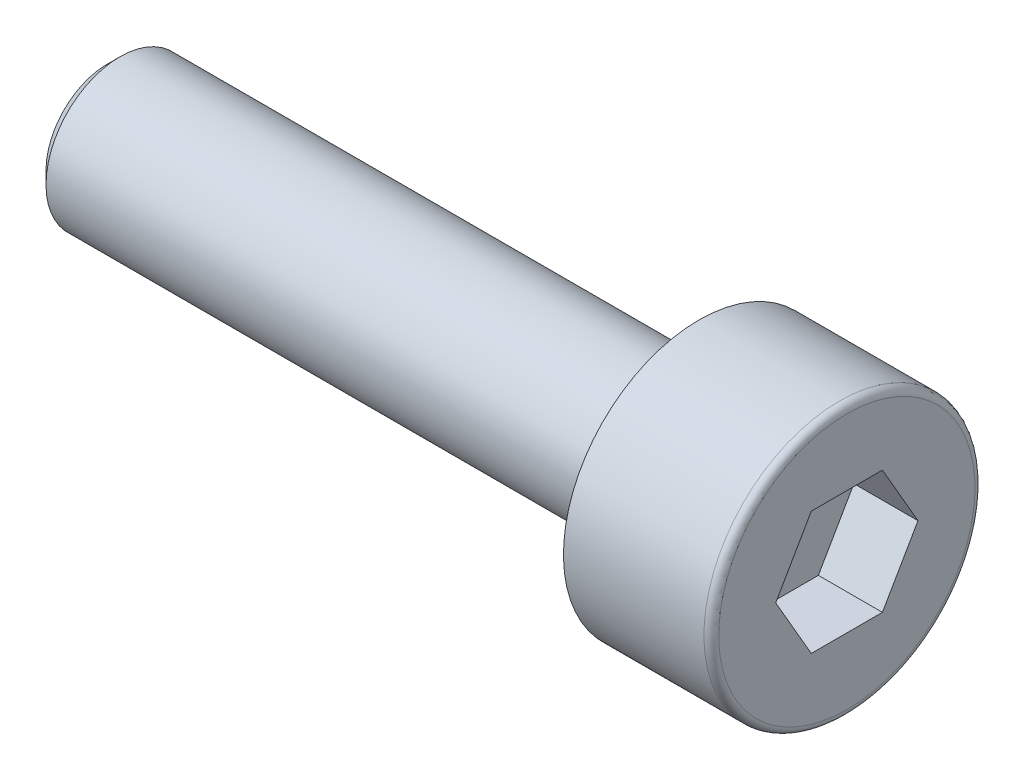
ISO-10303-21;
HEADER;
FILE_DESCRIPTION(('STEP AP214'),'2;1');
FILE_NAME('part.step','',(''),(''),'','','');
FILE_SCHEMA(('AUTOMOTIVE_DESIGN { 1 0 10303 214 1 1 1 1 }'));
ENDSEC;
DATA;
#1=APPLICATION_CONTEXT('core data for automotive mechanical design processes');
#2=APPLICATION_PROTOCOL_DEFINITION('international standard','automotive_design',2000,#1);
#3=PRODUCT_CONTEXT('',#1,'mechanical');
#4=PRODUCT('Part','Part','',(#3));
#5=PRODUCT_RELATED_PRODUCT_CATEGORY('part','',(#4));
#6=PRODUCT_DEFINITION_FORMATION('','',#4);
#7=PRODUCT_DEFINITION_CONTEXT('part definition',#1,'design');
#8=PRODUCT_DEFINITION('design','',#6,#7);
#9=PRODUCT_DEFINITION_SHAPE('','',#8);
#10=(LENGTH_UNIT() NAMED_UNIT(*) SI_UNIT(.MILLI.,.METRE.));
#11=(NAMED_UNIT(*) PLANE_ANGLE_UNIT() SI_UNIT($,.RADIAN.));
#12=(NAMED_UNIT(*) SI_UNIT($,.STERADIAN.) SOLID_ANGLE_UNIT());
#13=UNCERTAINTY_MEASURE_WITH_UNIT(LENGTH_MEASURE(1.E-05),#10,'distance_accuracy_value','');
#14=(GEOMETRIC_REPRESENTATION_CONTEXT(3) GLOBAL_UNCERTAINTY_ASSIGNED_CONTEXT((#13)) GLOBAL_UNIT_ASSIGNED_CONTEXT((#10,
#11,#12)) REPRESENTATION_CONTEXT('',''));
#15=CARTESIAN_POINT('',(0.,0.,0.));
#16=DIRECTION('',(0.,0.,1.));
#17=DIRECTION('',(1.,0.,0.));
#18=AXIS2_PLACEMENT_3D('',#15,#16,#17);
#19=CARTESIAN_POINT('',(0.,0.,0.));
#20=DIRECTION('',(1.,0.,0.));
#21=DIRECTION('',(0.,1.,0.));
#22=AXIS2_PLACEMENT_3D('',#19,#20,#21);
#23=PLANE('',#22);
#24=DIRECTION('',(0.,-0.866025403784439,0.5));
#25=VECTOR('',#24,1.);
#26=CARTESIAN_POINT('',(0.,1.25,0.721687836487035));
#27=LINE('',#26,#25);
#28=CARTESIAN_POINT('',(0.,1.25,0.721687836487035));
#29=VERTEX_POINT('',#28);
#30=CARTESIAN_POINT('',(0.,0.,1.44337567297407));
#31=VERTEX_POINT('',#30);
#32=EDGE_CURVE('E30',#29,#31,#27,.T.);
#33=ORIENTED_EDGE('',*,*,#32,.F.);
#34=DIRECTION('',(0.,0.,1.));
#35=VECTOR('',#34,1.);
#36=CARTESIAN_POINT('',(0.,1.25,-0.721687836487035));
#37=LINE('',#36,#35);
#38=CARTESIAN_POINT('',(0.,1.25,-0.721687836487035));
#39=VERTEX_POINT('',#38);
#40=EDGE_CURVE('E113',#39,#29,#37,.T.);
#41=ORIENTED_EDGE('',*,*,#40,.F.);
#42=DIRECTION('',(0.,0.866025403784439,0.5));
#43=VECTOR('',#42,1.);
#44=CARTESIAN_POINT('',(0.,0.,-1.44337567297406));
#45=LINE('',#44,#43);
#46=CARTESIAN_POINT('',(0.,0.,-1.44337567297406));
#47=VERTEX_POINT('',#46);
#48=EDGE_CURVE('E111',#47,#39,#45,.T.);
#49=ORIENTED_EDGE('',*,*,#48,.F.);
#50=DIRECTION('',(0.,0.866025403784439,-0.5));
#51=VECTOR('',#50,1.);
#52=CARTESIAN_POINT('',(0.,-1.25,-0.721687836487029));
#53=LINE('',#52,#51);
#54=CARTESIAN_POINT('',(0.,-1.25,-0.721687836487029));
#55=VERTEX_POINT('',#54);
#56=EDGE_CURVE('E78',#55,#47,#53,.T.);
#57=ORIENTED_EDGE('',*,*,#56,.F.);
#58=DIRECTION('',(0.,0.,-1.));
#59=VECTOR('',#58,1.);
#60=CARTESIAN_POINT('',(0.,-1.25,0.721687836487035));
#61=LINE('',#60,#59);
#62=CARTESIAN_POINT('',(0.,-1.25,0.721687836487035));
#63=VERTEX_POINT('',#62);
#64=EDGE_CURVE('E107',#63,#55,#61,.T.);
#65=ORIENTED_EDGE('',*,*,#64,.F.);
#66=DIRECTION('',(0.,-0.866025403784439,-0.5));
#67=VECTOR('',#66,1.);
#68=CARTESIAN_POINT('',(0.,0.,1.44337567297407));
#69=LINE('',#68,#67);
#70=EDGE_CURVE('E104',#31,#63,#69,.T.);
#71=ORIENTED_EDGE('',*,*,#70,.F.);
#72=EDGE_LOOP('',(#33,#41,#49,#57,#65,#71));
#73=FACE_BOUND('',#72,.T.);
#74=CARTESIAN_POINT('',(0.,0.,0.));
#75=DIRECTION('',(1.,0.,0.));
#76=DIRECTION('',(0.,1.,0.));
#77=AXIS2_PLACEMENT_3D('',#74,#75,#76);
#78=CIRCLE('',#77,2.6);
#79=CARTESIAN_POINT('',(0.,2.6,0.));
#80=VERTEX_POINT('',#79);
#81=EDGE_CURVE('E131',#80,#80,#78,.T.);
#82=ORIENTED_EDGE('',*,*,#81,.T.);
#83=EDGE_LOOP('',(#82));
#84=FACE_BOUND('',#83,.T.);
#85=ADVANCED_FACE('F15',(#73,#84),#23,.T.);
#86=CARTESIAN_POINT('',(-0.15,0.,0.));
#87=DIRECTION('',(1.,0.,0.));
#88=DIRECTION('',(0.,1.,0.));
#89=AXIS2_PLACEMENT_3D('',#86,#87,#88);
#90=TOROIDAL_SURFACE('',#89,2.6,0.15);
#91=CARTESIAN_POINT('',(-0.15,0.,0.));
#92=DIRECTION('',(1.,0.,0.));
#93=DIRECTION('',(0.,1.,0.));
#94=AXIS2_PLACEMENT_3D('',#91,#92,#93);
#95=CIRCLE('',#94,2.75);
#96=CARTESIAN_POINT('',(-0.15,2.75,0.));
#97=VERTEX_POINT('',#96);
#98=EDGE_CURVE('E128',#97,#97,#95,.T.);
#99=ORIENTED_EDGE('',*,*,#98,.T.);
#100=EDGE_LOOP('',(#99));
#101=FACE_BOUND('',#100,.T.);
#102=ORIENTED_EDGE('',*,*,#81,.F.);
#103=EDGE_LOOP('',(#102));
#104=FACE_BOUND('',#103,.T.);
#105=ADVANCED_FACE('F150',(#101,#104),#90,.T.);
#106=CARTESIAN_POINT('',(0.,0.,0.));
#107=DIRECTION('',(1.,0.,0.));
#108=DIRECTION('',(0.,1.,0.));
#109=AXIS2_PLACEMENT_3D('',#106,#107,#108);
#110=CYLINDRICAL_SURFACE('',#109,2.75);
#111=CARTESIAN_POINT('',(-3.,0.,0.));
#112=DIRECTION('',(1.,0.,0.));
#113=DIRECTION('',(0.,1.,0.));
#114=AXIS2_PLACEMENT_3D('',#111,#112,#113);
#115=CIRCLE('',#114,2.75);
#116=CARTESIAN_POINT('',(-3.,2.75,0.));
#117=VERTEX_POINT('',#116);
#118=EDGE_CURVE('E125',#117,#117,#115,.T.);
#119=ORIENTED_EDGE('',*,*,#118,.T.);
#120=EDGE_LOOP('',(#119));
#121=FACE_BOUND('',#120,.T.);
#122=ORIENTED_EDGE('',*,*,#98,.F.);
#123=EDGE_LOOP('',(#122));
#124=FACE_BOUND('',#123,.T.);
#125=ADVANCED_FACE('F156',(#121,#124),#110,.T.);
#126=CARTESIAN_POINT('',(-3.,2.75,0.));
#127=DIRECTION('',(-1.,0.,0.));
#128=DIRECTION('',(0.,-1.,0.));
#129=AXIS2_PLACEMENT_3D('',#126,#127,#128);
#130=PLANE('',#129);
#131=CARTESIAN_POINT('',(-3.,0.,0.));
#132=DIRECTION('',(1.,0.,0.));
#133=DIRECTION('',(0.,1.,0.));
#134=AXIS2_PLACEMENT_3D('',#131,#132,#133);
#135=CIRCLE('',#134,1.5);
#136=CARTESIAN_POINT('',(-3.,1.5,0.));
#137=VERTEX_POINT('',#136);
#138=EDGE_CURVE('E117',#137,#137,#135,.T.);
#139=ORIENTED_EDGE('',*,*,#138,.T.);
#140=EDGE_LOOP('',(#139));
#141=FACE_BOUND('',#140,.T.);
#142=ORIENTED_EDGE('',*,*,#118,.F.);
#143=EDGE_LOOP('',(#142));
#144=FACE_BOUND('',#143,.T.);
#145=ADVANCED_FACE('F163',(#141,#144),#130,.T.);
#146=CARTESIAN_POINT('',(0.,0.,0.));
#147=DIRECTION('',(1.,0.,0.));
#148=DIRECTION('',(0.,1.,0.));
#149=AXIS2_PLACEMENT_3D('',#146,#147,#148);
#150=CYLINDRICAL_SURFACE('',#149,1.5);
#151=CARTESIAN_POINT('',(-14.75,0.,0.));
#152=DIRECTION('',(-1.,0.,0.));
#153=DIRECTION('',(0.,-1.,0.));
#154=AXIS2_PLACEMENT_3D('',#151,#152,#153);
#155=CIRCLE('',#154,1.5);
#156=CARTESIAN_POINT('',(-14.75,-1.5,0.));
#157=VERTEX_POINT('',#156);
#158=EDGE_CURVE('E23',#157,#157,#155,.F.);
#159=ORIENTED_EDGE('',*,*,#158,.T.);
#160=EDGE_LOOP('',(#159));
#161=FACE_BOUND('',#160,.T.);
#162=ORIENTED_EDGE('',*,*,#138,.F.);
#163=EDGE_LOOP('',(#162));
#164=FACE_BOUND('',#163,.T.);
#165=ADVANCED_FACE('F136',(#161,#164),#150,.T.);
#166=CARTESIAN_POINT('',(-15.,1.5,0.));
#167=DIRECTION('',(-1.,0.,0.));
#168=DIRECTION('',(0.,-1.,0.));
#169=AXIS2_PLACEMENT_3D('',#166,#167,#168);
#170=PLANE('',#169);
#171=CARTESIAN_POINT('',(-15.,0.,0.));
#172=DIRECTION('',(-1.,0.,0.));
#173=DIRECTION('',(0.,-1.,0.));
#174=AXIS2_PLACEMENT_3D('',#171,#172,#173);
#175=CIRCLE('',#174,1.25);
#176=CARTESIAN_POINT('',(-15.,-1.25,0.));
#177=VERTEX_POINT('',#176);
#178=EDGE_CURVE('E9',#177,#177,#175,.T.);
#179=ORIENTED_EDGE('',*,*,#178,.T.);
#180=EDGE_LOOP('',(#179));
#181=FACE_BOUND('',#180,.T.);
#182=ADVANCED_FACE('F170',(#181),#170,.T.);
#183=CARTESIAN_POINT('',(-1.3,1.25,0.721687836487035));
#184=DIRECTION('',(0.,0.5,0.866025403784439));
#185=DIRECTION('',(0.,-0.866025403784439,0.5));
#186=AXIS2_PLACEMENT_3D('',#183,#184,#185);
#187=PLANE('',#186);
#188=ORIENTED_EDGE('',*,*,#32,.T.);
#189=DIRECTION('',(1.,0.,0.));
#190=VECTOR('',#189,1.);
#191=CARTESIAN_POINT('',(-1.3,0.,1.44337567297407));
#192=LINE('',#191,#190);
#193=CARTESIAN_POINT('',(-1.3,0.,1.44337567297407));
#194=VERTEX_POINT('',#193);
#195=EDGE_CURVE('E60',#194,#31,#192,.T.);
#196=ORIENTED_EDGE('',*,*,#195,.F.);
#197=DIRECTION('',(0.,-0.866025403784439,0.5));
#198=VECTOR('',#197,1.);
#199=CARTESIAN_POINT('',(-1.3,1.25,0.721687836487035));
#200=LINE('',#199,#198);
#201=CARTESIAN_POINT('',(-1.3,1.25,0.721687836487035));
#202=VERTEX_POINT('',#201);
#203=EDGE_CURVE('E115',#202,#194,#200,.T.);
#204=ORIENTED_EDGE('',*,*,#203,.F.);
#205=DIRECTION('',(1.,0.,0.));
#206=VECTOR('',#205,1.);
#207=CARTESIAN_POINT('',(-1.3,1.25,0.721687836487035));
#208=LINE('',#207,#206);
#209=EDGE_CURVE('E38',#202,#29,#208,.T.);
#210=ORIENTED_EDGE('',*,*,#209,.T.);
#211=EDGE_LOOP('',(#188,#196,#204,#210));
#212=FACE_BOUND('',#211,.T.);
#213=ADVANCED_FACE('F173',(#212),#187,.F.);
#214=CARTESIAN_POINT('',(-1.3,1.25,-0.721687836487035));
#215=DIRECTION('',(0.,1.,0.));
#216=DIRECTION('',(-1.,0.,0.));
#217=AXIS2_PLACEMENT_3D('',#214,#215,#216);
#218=PLANE('',#217);
#219=ORIENTED_EDGE('',*,*,#40,.T.);
#220=ORIENTED_EDGE('',*,*,#209,.F.);
#221=DIRECTION('',(0.,0.,1.));
#222=VECTOR('',#221,1.);
#223=CARTESIAN_POINT('',(-1.3,1.25,-0.721687836487035));
#224=LINE('',#223,#222);
#225=CARTESIAN_POINT('',(-1.3,1.25,-0.721687836487035));
#226=VERTEX_POINT('',#225);
#227=EDGE_CURVE('E90',#226,#202,#224,.T.);
#228=ORIENTED_EDGE('',*,*,#227,.F.);
#229=DIRECTION('',(1.,0.,0.));
#230=VECTOR('',#229,1.);
#231=CARTESIAN_POINT('',(-1.3,1.25,-0.721687836487035));
#232=LINE('',#231,#230);
#233=EDGE_CURVE('E82',#226,#39,#232,.T.);
#234=ORIENTED_EDGE('',*,*,#233,.T.);
#235=EDGE_LOOP('',(#219,#220,#228,#234));
#236=FACE_BOUND('',#235,.T.);
#237=ADVANCED_FACE('F177',(#236),#218,.F.);
#238=CARTESIAN_POINT('',(-1.3,0.,-1.44337567297406));
#239=DIRECTION('',(0.,0.5,-0.866025403784439));
#240=DIRECTION('',(0.,0.866025403784439,0.5));
#241=AXIS2_PLACEMENT_3D('',#238,#239,#240);
#242=PLANE('',#241);
#243=ORIENTED_EDGE('',*,*,#48,.T.);
#244=ORIENTED_EDGE('',*,*,#233,.F.);
#245=DIRECTION('',(0.,0.866025403784439,0.5));
#246=VECTOR('',#245,1.);
#247=CARTESIAN_POINT('',(-1.3,0.,-1.44337567297406));
#248=LINE('',#247,#246);
#249=CARTESIAN_POINT('',(-1.3,0.,-1.44337567297406));
#250=VERTEX_POINT('',#249);
#251=EDGE_CURVE('E86',#250,#226,#248,.T.);
#252=ORIENTED_EDGE('',*,*,#251,.F.);
#253=DIRECTION('',(1.,0.,0.));
#254=VECTOR('',#253,1.);
#255=CARTESIAN_POINT('',(-1.3,0.,-1.44337567297406));
#256=LINE('',#255,#254);
#257=EDGE_CURVE('E71',#250,#47,#256,.T.);
#258=ORIENTED_EDGE('',*,*,#257,.T.);
#259=EDGE_LOOP('',(#243,#244,#252,#258));
#260=FACE_BOUND('',#259,.T.);
#261=ADVANCED_FACE('F87',(#260),#242,.F.);
#262=CARTESIAN_POINT('',(-1.3,-1.25,-0.721687836487029));
#263=DIRECTION('',(0.,-0.5,-0.866025403784439));
#264=DIRECTION('',(0.,0.866025403784439,-0.5));
#265=AXIS2_PLACEMENT_3D('',#262,#263,#264);
#266=PLANE('',#265);
#267=ORIENTED_EDGE('',*,*,#56,.T.);
#268=ORIENTED_EDGE('',*,*,#257,.F.);
#269=DIRECTION('',(0.,0.866025403784439,-0.5));
#270=VECTOR('',#269,1.);
#271=CARTESIAN_POINT('',(-1.3,-1.25,-0.721687836487029));
#272=LINE('',#271,#270);
#273=CARTESIAN_POINT('',(-1.3,-1.25,-0.721687836487029));
#274=VERTEX_POINT('',#273);
#275=EDGE_CURVE('E75',#274,#250,#272,.T.);
#276=ORIENTED_EDGE('',*,*,#275,.F.);
#277=DIRECTION('',(1.,0.,0.));
#278=VECTOR('',#277,1.);
#279=CARTESIAN_POINT('',(-1.3,-1.25,-0.721687836487029));
#280=LINE('',#279,#278);
#281=EDGE_CURVE('E83',#274,#55,#280,.T.);
#282=ORIENTED_EDGE('',*,*,#281,.T.);
#283=EDGE_LOOP('',(#267,#268,#276,#282));
#284=FACE_BOUND('',#283,.T.);
#285=ADVANCED_FACE('F73',(#284),#266,.F.);
#286=CARTESIAN_POINT('',(-1.3,-1.25,0.721687836487035));
#287=DIRECTION('',(0.,-1.,0.));
#288=DIRECTION('',(0.,0.,-1.));
#289=AXIS2_PLACEMENT_3D('',#286,#287,#288);
#290=PLANE('',#289);
#291=ORIENTED_EDGE('',*,*,#64,.T.);
#292=ORIENTED_EDGE('',*,*,#281,.F.);
#293=DIRECTION('',(0.,0.,-1.));
#294=VECTOR('',#293,1.);
#295=CARTESIAN_POINT('',(-1.3,-1.25,0.721687836487035));
#296=LINE('',#295,#294);
#297=CARTESIAN_POINT('',(-1.3,-1.25,0.721687836487035));
#298=VERTEX_POINT('',#297);
#299=EDGE_CURVE('E96',#298,#274,#296,.T.);
#300=ORIENTED_EDGE('',*,*,#299,.F.);
#301=DIRECTION('',(1.,0.,0.));
#302=VECTOR('',#301,1.);
#303=CARTESIAN_POINT('',(-1.3,-1.25,0.721687836487035));
#304=LINE('',#303,#302);
#305=EDGE_CURVE('E120',#298,#63,#304,.T.);
#306=ORIENTED_EDGE('',*,*,#305,.T.);
#307=EDGE_LOOP('',(#291,#292,#300,#306));
#308=FACE_BOUND('',#307,.T.);
#309=ADVANCED_FACE('F180',(#308),#290,.F.);
#310=CARTESIAN_POINT('',(-1.3,0.,1.44337567297407));
#311=DIRECTION('',(0.,-0.5,0.866025403784439));
#312=DIRECTION('',(0.,-0.866025403784439,-0.5));
#313=AXIS2_PLACEMENT_3D('',#310,#311,#312);
#314=PLANE('',#313);
#315=ORIENTED_EDGE('',*,*,#70,.T.);
#316=ORIENTED_EDGE('',*,*,#305,.F.);
#317=DIRECTION('',(0.,-0.866025403784439,-0.5));
#318=VECTOR('',#317,1.);
#319=CARTESIAN_POINT('',(-1.3,0.,1.44337567297407));
#320=LINE('',#319,#318);
#321=EDGE_CURVE('E98',#194,#298,#320,.T.);
#322=ORIENTED_EDGE('',*,*,#321,.F.);
#323=ORIENTED_EDGE('',*,*,#195,.T.);
#324=EDGE_LOOP('',(#315,#316,#322,#323));
#325=FACE_BOUND('',#324,.T.);
#326=ADVANCED_FACE('F146',(#325),#314,.F.);
#327=CARTESIAN_POINT('',(-1.3,0.,1.44337567297407));
#328=DIRECTION('',(1.,0.,0.));
#329=DIRECTION('',(0.,1.,0.));
#330=AXIS2_PLACEMENT_3D('',#327,#328,#329);
#331=PLANE('',#330);
#332=ORIENTED_EDGE('',*,*,#203,.T.);
#333=ORIENTED_EDGE('',*,*,#321,.T.);
#334=ORIENTED_EDGE('',*,*,#299,.T.);
#335=ORIENTED_EDGE('',*,*,#275,.T.);
#336=ORIENTED_EDGE('',*,*,#251,.T.);
#337=ORIENTED_EDGE('',*,*,#227,.T.);
#338=EDGE_LOOP('',(#332,#333,#334,#335,#336,#337));
#339=FACE_BOUND('',#338,.T.);
#340=ADVANCED_FACE('F93',(#339),#331,.T.);
#341=CARTESIAN_POINT('',(-14.75,0.,0.));
#342=DIRECTION('',(1.,0.,0.));
#343=DIRECTION('',(0.,1.,0.));
#344=AXIS2_PLACEMENT_3D('',#341,#342,#343);
#345=CONICAL_SURFACE('',#344,1.5,0.785398163397452);
#346=ORIENTED_EDGE('',*,*,#178,.F.);
#347=EDGE_LOOP('',(#346));
#348=FACE_BOUND('',#347,.T.);
#349=ORIENTED_EDGE('',*,*,#158,.F.);
#350=EDGE_LOOP('',(#349));
#351=FACE_BOUND('',#350,.T.);
#352=ADVANCED_FACE('F17',(#348,#351),#345,.T.);
#353=CLOSED_SHELL('',(#85,#105,#125,#145,#165,#182,#213,#237,#261,#285,#309,#326,#340,#352));
#354=MANIFOLD_SOLID_BREP('B1',#353);
#355=ADVANCED_BREP_SHAPE_REPRESENTATION('',(#18,#354),#14);
#356=SHAPE_DEFINITION_REPRESENTATION(#9,#355);
ENDSEC;
END-ISO-10303-21;
